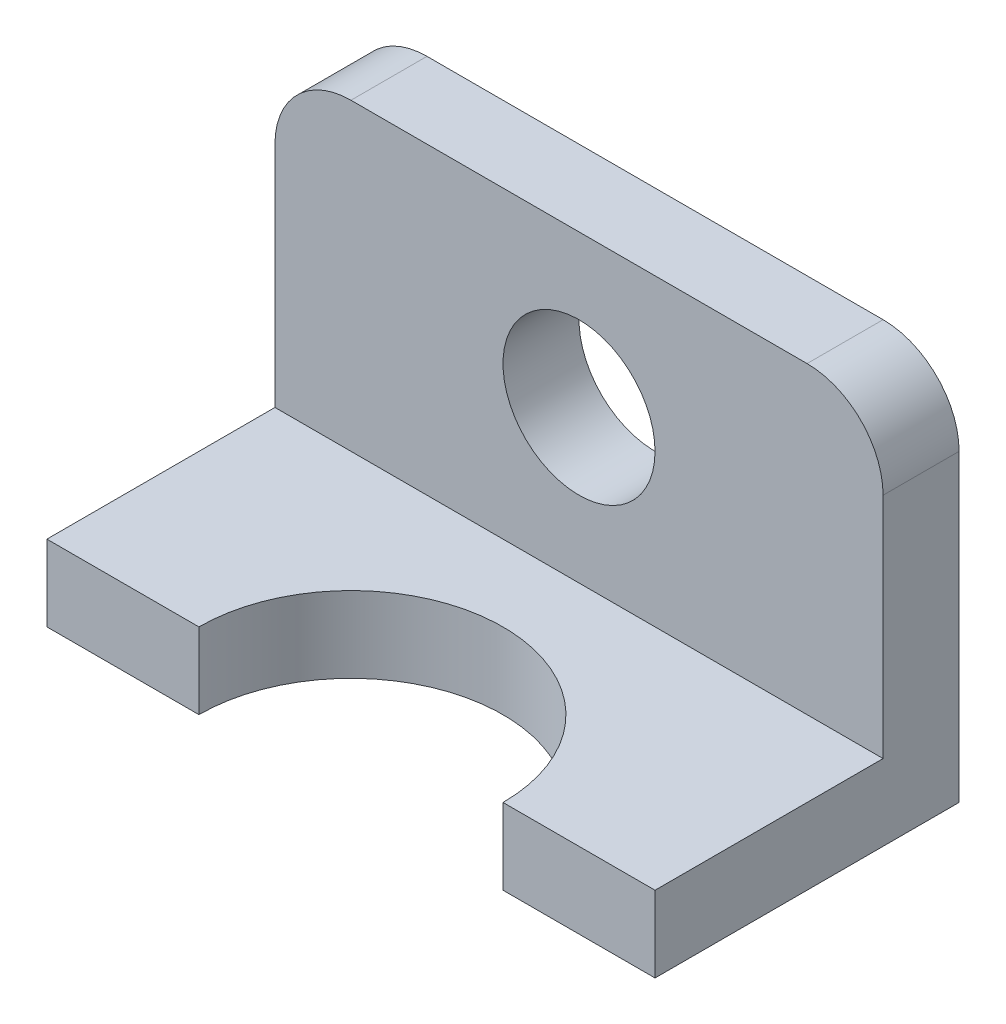
ISO-10303-21;
HEADER;
FILE_DESCRIPTION(('STEP AP214'),'2;1');
FILE_NAME('part.step','',(''),(''),'','','');
FILE_SCHEMA(('AUTOMOTIVE_DESIGN { 1 0 10303 214 1 1 1 1 }'));
ENDSEC;
DATA;
#1=APPLICATION_CONTEXT('core data for automotive mechanical design processes');
#2=APPLICATION_PROTOCOL_DEFINITION('international standard','automotive_design',2000,#1);
#3=PRODUCT_CONTEXT('',#1,'mechanical');
#4=PRODUCT('Part','Part','',(#3));
#5=PRODUCT_RELATED_PRODUCT_CATEGORY('part','',(#4));
#6=PRODUCT_DEFINITION_FORMATION('','',#4);
#7=PRODUCT_DEFINITION_CONTEXT('part definition',#1,'design');
#8=PRODUCT_DEFINITION('design','',#6,#7);
#9=PRODUCT_DEFINITION_SHAPE('','',#8);
#10=(LENGTH_UNIT() NAMED_UNIT(*) SI_UNIT(.MILLI.,.METRE.));
#11=(NAMED_UNIT(*) PLANE_ANGLE_UNIT() SI_UNIT($,.RADIAN.));
#12=(NAMED_UNIT(*) SI_UNIT($,.STERADIAN.) SOLID_ANGLE_UNIT());
#13=UNCERTAINTY_MEASURE_WITH_UNIT(LENGTH_MEASURE(1.E-05),#10,'distance_accuracy_value','');
#14=(GEOMETRIC_REPRESENTATION_CONTEXT(3) GLOBAL_UNCERTAINTY_ASSIGNED_CONTEXT((#13)) GLOBAL_UNIT_ASSIGNED_CONTEXT((#10,
#11,#12)) REPRESENTATION_CONTEXT('',''));
#15=CARTESIAN_POINT('',(0.,0.,0.));
#16=DIRECTION('',(0.,0.,1.));
#17=DIRECTION('',(1.,0.,0.));
#18=AXIS2_PLACEMENT_3D('',#15,#16,#17);
#19=CARTESIAN_POINT('',(0.,12.7,50.8));
#20=DIRECTION('',(0.,-1.,0.));
#21=DIRECTION('',(0.,0.,-1.));
#22=AXIS2_PLACEMENT_3D('',#19,#20,#21);
#23=PLANE('',#22);
#24=DIRECTION('',(1.,0.,0.));
#25=VECTOR('',#24,1.);
#26=CARTESIAN_POINT('',(-50.8,12.7,12.7));
#27=LINE('',#26,#25);
#28=CARTESIAN_POINT('',(-50.8,12.7,12.7));
#29=VERTEX_POINT('',#28);
#30=CARTESIAN_POINT('',(50.8,12.7,12.7));
#31=VERTEX_POINT('',#30);
#32=EDGE_CURVE('E127',#29,#31,#27,.T.);
#33=ORIENTED_EDGE('',*,*,#32,.F.);
#34=DIRECTION('',(0.,0.,1.));
#35=VECTOR('',#34,1.);
#36=CARTESIAN_POINT('',(-50.8,12.7,50.8));
#37=LINE('',#36,#35);
#38=CARTESIAN_POINT('',(-50.8,12.7,50.8));
#39=VERTEX_POINT('',#38);
#40=EDGE_CURVE('E132',#29,#39,#37,.T.);
#41=ORIENTED_EDGE('',*,*,#40,.T.);
#42=DIRECTION('',(1.,0.,0.));
#43=VECTOR('',#42,1.);
#44=CARTESIAN_POINT('',(-50.8,12.7,50.8));
#45=LINE('',#44,#43);
#46=CARTESIAN_POINT('',(-25.4,12.7,50.8));
#47=VERTEX_POINT('',#46);
#48=EDGE_CURVE('E147',#39,#47,#45,.T.);
#49=ORIENTED_EDGE('',*,*,#48,.T.);
#50=CARTESIAN_POINT('',(0.,12.7,50.8));
#51=DIRECTION('',(0.,-1.,0.));
#52=DIRECTION('',(0.,0.,-1.));
#53=AXIS2_PLACEMENT_3D('',#50,#51,#52);
#54=CIRCLE('',#53,25.4);
#55=CARTESIAN_POINT('',(25.4,12.7,50.8));
#56=VERTEX_POINT('',#55);
#57=EDGE_CURVE('E150',#47,#56,#54,.T.);
#58=ORIENTED_EDGE('',*,*,#57,.T.);
#59=DIRECTION('',(1.,0.,0.));
#60=VECTOR('',#59,1.);
#61=CARTESIAN_POINT('',(50.8,12.7,50.8));
#62=LINE('',#61,#60);
#63=CARTESIAN_POINT('',(50.8,12.7,50.8));
#64=VERTEX_POINT('',#63);
#65=EDGE_CURVE('E130',#56,#64,#62,.T.);
#66=ORIENTED_EDGE('',*,*,#65,.T.);
#67=DIRECTION('',(0.,0.,-1.));
#68=VECTOR('',#67,1.);
#69=CARTESIAN_POINT('',(50.8,12.7,0.));
#70=LINE('',#69,#68);
#71=EDGE_CURVE('E119',#64,#31,#70,.T.);
#72=ORIENTED_EDGE('',*,*,#71,.T.);
#73=EDGE_LOOP('',(#33,#41,#49,#58,#66,#72));
#74=FACE_BOUND('',#73,.T.);
#75=ADVANCED_FACE('F40',(#74),#23,.F.);
#76=CARTESIAN_POINT('',(-50.8,12.7,50.8));
#77=DIRECTION('',(0.,0.,-1.));
#78=DIRECTION('',(-1.,0.,0.));
#79=AXIS2_PLACEMENT_3D('',#76,#77,#78);
#80=PLANE('',#79);
#81=DIRECTION('',(1.,0.,0.));
#82=VECTOR('',#81,1.);
#83=CARTESIAN_POINT('',(-50.8,0.,50.8));
#84=LINE('',#83,#82);
#85=CARTESIAN_POINT('',(-50.8,0.,50.8));
#86=VERTEX_POINT('',#85);
#87=CARTESIAN_POINT('',(-25.4,0.,50.8));
#88=VERTEX_POINT('',#87);
#89=EDGE_CURVE('E146',#86,#88,#84,.T.);
#90=ORIENTED_EDGE('',*,*,#89,.T.);
#91=DIRECTION('',(0.,-1.,0.));
#92=VECTOR('',#91,1.);
#93=CARTESIAN_POINT('',(-25.4,12.7,50.8));
#94=LINE('',#93,#92);
#95=EDGE_CURVE('E180',#47,#88,#94,.T.);
#96=ORIENTED_EDGE('',*,*,#95,.F.);
#97=ORIENTED_EDGE('',*,*,#48,.F.);
#98=DIRECTION('',(0.,-1.,0.));
#99=VECTOR('',#98,1.);
#100=CARTESIAN_POINT('',(-50.8,12.7,50.8));
#101=LINE('',#100,#99);
#102=EDGE_CURVE('E155',#39,#86,#101,.T.);
#103=ORIENTED_EDGE('',*,*,#102,.T.);
#104=EDGE_LOOP('',(#90,#96,#97,#103));
#105=FACE_BOUND('',#104,.T.);
#106=ADVANCED_FACE('F222',(#105),#80,.F.);
#107=CARTESIAN_POINT('',(0.,12.7,50.8));
#108=DIRECTION('',(0.,-1.,0.));
#109=DIRECTION('',(0.,0.,-1.));
#110=AXIS2_PLACEMENT_3D('',#107,#108,#109);
#111=CYLINDRICAL_SURFACE('',#110,25.4);
#112=CARTESIAN_POINT('',(0.,0.,50.8));
#113=DIRECTION('',(0.,-1.,0.));
#114=DIRECTION('',(0.,0.,-1.));
#115=AXIS2_PLACEMENT_3D('',#112,#113,#114);
#116=CIRCLE('',#115,25.4);
#117=CARTESIAN_POINT('',(25.4,0.,50.8));
#118=VERTEX_POINT('',#117);
#119=EDGE_CURVE('E158',#88,#118,#116,.T.);
#120=ORIENTED_EDGE('',*,*,#119,.T.);
#121=DIRECTION('',(0.,-1.,0.));
#122=VECTOR('',#121,1.);
#123=CARTESIAN_POINT('',(25.4,12.7,50.8));
#124=LINE('',#123,#122);
#125=EDGE_CURVE('E177',#56,#118,#124,.T.);
#126=ORIENTED_EDGE('',*,*,#125,.F.);
#127=ORIENTED_EDGE('',*,*,#57,.F.);
#128=ORIENTED_EDGE('',*,*,#95,.T.);
#129=EDGE_LOOP('',(#120,#126,#127,#128));
#130=FACE_BOUND('',#129,.T.);
#131=ADVANCED_FACE('F224',(#130),#111,.F.);
#132=CARTESIAN_POINT('',(50.8,12.7,50.8));
#133=DIRECTION('',(0.,0.,-1.));
#134=DIRECTION('',(-1.,0.,0.));
#135=AXIS2_PLACEMENT_3D('',#132,#133,#134);
#136=PLANE('',#135);
#137=DIRECTION('',(1.,0.,0.));
#138=VECTOR('',#137,1.);
#139=CARTESIAN_POINT('',(50.8,0.,50.8));
#140=LINE('',#139,#138);
#141=CARTESIAN_POINT('',(50.8,0.,50.8));
#142=VERTEX_POINT('',#141);
#143=EDGE_CURVE('E160',#118,#142,#140,.T.);
#144=ORIENTED_EDGE('',*,*,#143,.T.);
#145=DIRECTION('',(0.,-1.,0.));
#146=VECTOR('',#145,1.);
#147=CARTESIAN_POINT('',(50.8,12.7,50.8));
#148=LINE('',#147,#146);
#149=EDGE_CURVE('E175',#64,#142,#148,.T.);
#150=ORIENTED_EDGE('',*,*,#149,.F.);
#151=ORIENTED_EDGE('',*,*,#65,.F.);
#152=ORIENTED_EDGE('',*,*,#125,.T.);
#153=EDGE_LOOP('',(#144,#150,#151,#152));
#154=FACE_BOUND('',#153,.T.);
#155=ADVANCED_FACE('F226',(#154),#136,.F.);
#156=CARTESIAN_POINT('',(50.8,12.7,0.));
#157=DIRECTION('',(-1.,0.,0.));
#158=DIRECTION('',(0.,0.,1.));
#159=AXIS2_PLACEMENT_3D('',#156,#157,#158);
#160=PLANE('',#159);
#161=DIRECTION('',(0.,-1.,0.));
#162=VECTOR('',#161,1.);
#163=CARTESIAN_POINT('',(50.8,12.7,0.));
#164=LINE('',#163,#162);
#165=CARTESIAN_POINT('',(50.8,50.8,0.));
#166=VERTEX_POINT('',#165);
#167=CARTESIAN_POINT('',(50.8,0.,0.));
#168=VERTEX_POINT('',#167);
#169=EDGE_CURVE('E173',#166,#168,#164,.T.);
#170=ORIENTED_EDGE('',*,*,#169,.F.);
#171=DIRECTION('',(0.,0.,-1.));
#172=VECTOR('',#171,1.);
#173=CARTESIAN_POINT('',(50.8,50.8,12.7));
#174=LINE('',#173,#172);
#175=CARTESIAN_POINT('',(50.8,50.8,12.7));
#176=VERTEX_POINT('',#175);
#177=EDGE_CURVE('E63',#166,#176,#174,.F.);
#178=ORIENTED_EDGE('',*,*,#177,.T.);
#179=DIRECTION('',(0.,-1.,0.));
#180=VECTOR('',#179,1.);
#181=CARTESIAN_POINT('',(50.8,63.5,12.7));
#182=LINE('',#181,#180);
#183=EDGE_CURVE('E115',#176,#31,#182,.T.);
#184=ORIENTED_EDGE('',*,*,#183,.T.);
#185=ORIENTED_EDGE('',*,*,#71,.F.);
#186=ORIENTED_EDGE('',*,*,#149,.T.);
#187=DIRECTION('',(0.,0.,-1.));
#188=VECTOR('',#187,1.);
#189=CARTESIAN_POINT('',(50.8,0.,0.));
#190=LINE('',#189,#188);
#191=EDGE_CURVE('E162',#142,#168,#190,.T.);
#192=ORIENTED_EDGE('',*,*,#191,.T.);
#193=EDGE_LOOP('',(#170,#178,#184,#185,#186,#192));
#194=FACE_BOUND('',#193,.T.);
#195=ADVANCED_FACE('F117',(#194),#160,.F.);
#196=CARTESIAN_POINT('',(-50.8,12.7,0.));
#197=DIRECTION('',(0.,0.,1.));
#198=DIRECTION('',(1.,0.,0.));
#199=AXIS2_PLACEMENT_3D('',#196,#197,#198);
#200=PLANE('',#199);
#201=CARTESIAN_POINT('',(0.,38.1,0.));
#202=DIRECTION('',(0.,0.,1.));
#203=DIRECTION('',(1.,0.,0.));
#204=AXIS2_PLACEMENT_3D('',#201,#202,#203);
#205=CIRCLE('',#204,12.7);
#206=CARTESIAN_POINT('',(12.7,38.1,0.));
#207=VERTEX_POINT('',#206);
#208=EDGE_CURVE('E136',#207,#207,#205,.T.);
#209=ORIENTED_EDGE('',*,*,#208,.T.);
#210=EDGE_LOOP('',(#209));
#211=FACE_BOUND('',#210,.T.);
#212=DIRECTION('',(-1.,0.,0.));
#213=VECTOR('',#212,1.);
#214=CARTESIAN_POINT('',(-50.8,63.5,0.));
#215=LINE('',#214,#213);
#216=CARTESIAN_POINT('',(38.1,63.5,0.));
#217=VERTEX_POINT('',#216);
#218=CARTESIAN_POINT('',(-38.1,63.5,0.));
#219=VERTEX_POINT('',#218);
#220=EDGE_CURVE('E123',#217,#219,#215,.T.);
#221=ORIENTED_EDGE('',*,*,#220,.F.);
#222=CARTESIAN_POINT('',(38.1,50.8,0.));
#223=DIRECTION('',(0.,0.,1.));
#224=DIRECTION('',(1.,0.,0.));
#225=AXIS2_PLACEMENT_3D('',#222,#223,#224);
#226=CIRCLE('',#225,12.7);
#227=EDGE_CURVE('E191',#217,#166,#226,.F.);
#228=ORIENTED_EDGE('',*,*,#227,.T.);
#229=ORIENTED_EDGE('',*,*,#169,.T.);
#230=DIRECTION('',(-1.,0.,0.));
#231=VECTOR('',#230,1.);
#232=CARTESIAN_POINT('',(-50.8,0.,0.));
#233=LINE('',#232,#231);
#234=CARTESIAN_POINT('',(-50.8,0.,0.));
#235=VERTEX_POINT('',#234);
#236=EDGE_CURVE('E165',#168,#235,#233,.T.);
#237=ORIENTED_EDGE('',*,*,#236,.T.);
#238=DIRECTION('',(0.,-1.,0.));
#239=VECTOR('',#238,1.);
#240=CARTESIAN_POINT('',(-50.8,12.7,0.));
#241=LINE('',#240,#239);
#242=CARTESIAN_POINT('',(-50.8,50.8,0.));
#243=VERTEX_POINT('',#242);
#244=EDGE_CURVE('E171',#243,#235,#241,.T.);
#245=ORIENTED_EDGE('',*,*,#244,.F.);
#246=CARTESIAN_POINT('',(-38.1,50.8,0.));
#247=DIRECTION('',(0.,0.,1.));
#248=DIRECTION('',(1.,0.,0.));
#249=AXIS2_PLACEMENT_3D('',#246,#247,#248);
#250=CIRCLE('',#249,12.7);
#251=EDGE_CURVE('E189',#243,#219,#250,.F.);
#252=ORIENTED_EDGE('',*,*,#251,.T.);
#253=EDGE_LOOP('',(#221,#228,#229,#237,#245,#252));
#254=FACE_BOUND('',#253,.T.);
#255=ADVANCED_FACE('F203',(#211,#254),#200,.F.);
#256=CARTESIAN_POINT('',(-50.8,12.7,50.8));
#257=DIRECTION('',(1.,0.,0.));
#258=DIRECTION('',(0.,0.,-1.));
#259=AXIS2_PLACEMENT_3D('',#256,#257,#258);
#260=PLANE('',#259);
#261=DIRECTION('',(0.,-1.,0.));
#262=VECTOR('',#261,1.);
#263=CARTESIAN_POINT('',(-50.8,63.5,12.7));
#264=LINE('',#263,#262);
#265=CARTESIAN_POINT('',(-50.8,50.8,12.7));
#266=VERTEX_POINT('',#265);
#267=EDGE_CURVE('E122',#266,#29,#264,.T.);
#268=ORIENTED_EDGE('',*,*,#267,.F.);
#269=DIRECTION('',(0.,0.,1.));
#270=VECTOR('',#269,1.);
#271=CARTESIAN_POINT('',(-50.8,50.8,0.));
#272=LINE('',#271,#270);
#273=EDGE_CURVE('E11',#266,#243,#272,.F.);
#274=ORIENTED_EDGE('',*,*,#273,.T.);
#275=ORIENTED_EDGE('',*,*,#244,.T.);
#276=DIRECTION('',(0.,0.,1.));
#277=VECTOR('',#276,1.);
#278=CARTESIAN_POINT('',(-50.8,0.,50.8));
#279=LINE('',#278,#277);
#280=EDGE_CURVE('E151',#235,#86,#279,.T.);
#281=ORIENTED_EDGE('',*,*,#280,.T.);
#282=ORIENTED_EDGE('',*,*,#102,.F.);
#283=ORIENTED_EDGE('',*,*,#40,.F.);
#284=EDGE_LOOP('',(#268,#274,#275,#281,#282,#283));
#285=FACE_BOUND('',#284,.T.);
#286=ADVANCED_FACE('F216',(#285),#260,.F.);
#287=CARTESIAN_POINT('',(0.,0.,50.8));
#288=DIRECTION('',(0.,-1.,0.));
#289=DIRECTION('',(0.,0.,-1.));
#290=AXIS2_PLACEMENT_3D('',#287,#288,#289);
#291=PLANE('',#290);
#292=ORIENTED_EDGE('',*,*,#89,.F.);
#293=ORIENTED_EDGE('',*,*,#280,.F.);
#294=ORIENTED_EDGE('',*,*,#236,.F.);
#295=ORIENTED_EDGE('',*,*,#191,.F.);
#296=ORIENTED_EDGE('',*,*,#143,.F.);
#297=ORIENTED_EDGE('',*,*,#119,.F.);
#298=EDGE_LOOP('',(#292,#293,#294,#295,#296,#297));
#299=FACE_BOUND('',#298,.T.);
#300=ADVANCED_FACE('F210',(#299),#291,.T.);
#301=CARTESIAN_POINT('',(-50.8,63.5,12.7));
#302=DIRECTION('',(0.,0.,-1.));
#303=DIRECTION('',(-1.,0.,0.));
#304=AXIS2_PLACEMENT_3D('',#301,#302,#303);
#305=PLANE('',#304);
#306=CARTESIAN_POINT('',(0.,38.1,12.7));
#307=DIRECTION('',(0.,0.,1.));
#308=DIRECTION('',(1.,0.,0.));
#309=AXIS2_PLACEMENT_3D('',#306,#307,#308);
#310=CIRCLE('',#309,12.7);
#311=CARTESIAN_POINT('',(12.7,38.1,12.7));
#312=VERTEX_POINT('',#311);
#313=EDGE_CURVE('E141',#312,#312,#310,.T.);
#314=ORIENTED_EDGE('',*,*,#313,.F.);
#315=EDGE_LOOP('',(#314));
#316=FACE_BOUND('',#315,.T.);
#317=ORIENTED_EDGE('',*,*,#183,.F.);
#318=CARTESIAN_POINT('',(38.1,50.8,12.7));
#319=DIRECTION('',(0.,0.,-1.));
#320=DIRECTION('',(-1.,0.,0.));
#321=AXIS2_PLACEMENT_3D('',#318,#319,#320);
#322=CIRCLE('',#321,12.7);
#323=CARTESIAN_POINT('',(38.1,63.5,12.7));
#324=VERTEX_POINT('',#323);
#325=EDGE_CURVE('E48',#176,#324,#322,.F.);
#326=ORIENTED_EDGE('',*,*,#325,.T.);
#327=DIRECTION('',(1.,0.,0.));
#328=VECTOR('',#327,1.);
#329=CARTESIAN_POINT('',(-50.8,63.5,12.7));
#330=LINE('',#329,#328);
#331=CARTESIAN_POINT('',(-38.1,63.5,12.7));
#332=VERTEX_POINT('',#331);
#333=EDGE_CURVE('E135',#332,#324,#330,.T.);
#334=ORIENTED_EDGE('',*,*,#333,.F.);
#335=CARTESIAN_POINT('',(-38.1,50.8,12.7));
#336=DIRECTION('',(0.,0.,-1.));
#337=DIRECTION('',(-1.,0.,0.));
#338=AXIS2_PLACEMENT_3D('',#335,#336,#337);
#339=CIRCLE('',#338,12.7);
#340=EDGE_CURVE('E55',#332,#266,#339,.F.);
#341=ORIENTED_EDGE('',*,*,#340,.T.);
#342=ORIENTED_EDGE('',*,*,#267,.T.);
#343=ORIENTED_EDGE('',*,*,#32,.T.);
#344=EDGE_LOOP('',(#317,#326,#334,#341,#342,#343));
#345=FACE_BOUND('',#344,.T.);
#346=ADVANCED_FACE('F134',(#316,#345),#305,.F.);
#347=CARTESIAN_POINT('',(0.,63.5,0.));
#348=DIRECTION('',(0.,1.,0.));
#349=DIRECTION('',(0.,0.,1.));
#350=AXIS2_PLACEMENT_3D('',#347,#348,#349);
#351=PLANE('',#350);
#352=ORIENTED_EDGE('',*,*,#333,.T.);
#353=DIRECTION('',(0.,0.,-1.));
#354=VECTOR('',#353,1.);
#355=CARTESIAN_POINT('',(38.1,63.5,0.));
#356=LINE('',#355,#354);
#357=EDGE_CURVE('E186',#324,#217,#356,.T.);
#358=ORIENTED_EDGE('',*,*,#357,.T.);
#359=ORIENTED_EDGE('',*,*,#220,.T.);
#360=DIRECTION('',(0.,0.,1.));
#361=VECTOR('',#360,1.);
#362=CARTESIAN_POINT('',(-38.1,63.5,12.7));
#363=LINE('',#362,#361);
#364=EDGE_CURVE('E183',#219,#332,#363,.T.);
#365=ORIENTED_EDGE('',*,*,#364,.T.);
#366=EDGE_LOOP('',(#352,#358,#359,#365));
#367=FACE_BOUND('',#366,.T.);
#368=ADVANCED_FACE('F197',(#367),#351,.T.);
#369=CARTESIAN_POINT('',(0.,38.1,0.));
#370=DIRECTION('',(0.,0.,1.));
#371=DIRECTION('',(1.,0.,0.));
#372=AXIS2_PLACEMENT_3D('',#369,#370,#371);
#373=CYLINDRICAL_SURFACE('',#372,12.7);
#374=ORIENTED_EDGE('',*,*,#208,.F.);
#375=EDGE_LOOP('',(#374));
#376=FACE_BOUND('',#375,.T.);
#377=ORIENTED_EDGE('',*,*,#313,.T.);
#378=EDGE_LOOP('',(#377));
#379=FACE_BOUND('',#378,.T.);
#380=ADVANCED_FACE('F254',(#376,#379),#373,.F.);
#381=CARTESIAN_POINT('',(38.1,50.8,0.));
#382=DIRECTION('',(0.,0.,1.));
#383=DIRECTION('',(1.,0.,0.));
#384=AXIS2_PLACEMENT_3D('',#381,#382,#383);
#385=CYLINDRICAL_SURFACE('',#384,12.7);
#386=ORIENTED_EDGE('',*,*,#325,.F.);
#387=ORIENTED_EDGE('',*,*,#177,.F.);
#388=ORIENTED_EDGE('',*,*,#227,.F.);
#389=ORIENTED_EDGE('',*,*,#357,.F.);
#390=EDGE_LOOP('',(#386,#387,#388,#389));
#391=FACE_BOUND('',#390,.T.);
#392=ADVANCED_FACE('F201',(#391),#385,.T.);
#393=CARTESIAN_POINT('',(-38.1,50.8,0.));
#394=DIRECTION('',(0.,0.,-1.));
#395=DIRECTION('',(-1.,0.,0.));
#396=AXIS2_PLACEMENT_3D('',#393,#394,#395);
#397=CYLINDRICAL_SURFACE('',#396,12.7);
#398=ORIENTED_EDGE('',*,*,#251,.F.);
#399=ORIENTED_EDGE('',*,*,#273,.F.);
#400=ORIENTED_EDGE('',*,*,#340,.F.);
#401=ORIENTED_EDGE('',*,*,#364,.F.);
#402=EDGE_LOOP('',(#398,#399,#400,#401));
#403=FACE_BOUND('',#402,.T.);
#404=ADVANCED_FACE('F42',(#403),#397,.T.);
#405=CLOSED_SHELL('',(#75,#106,#131,#155,#195,#255,#286,#300,#346,#368,#380,#392,#404));
#406=MANIFOLD_SOLID_BREP('B2',#405);
#407=ADVANCED_BREP_SHAPE_REPRESENTATION('',(#18,#406),#14);
#408=SHAPE_DEFINITION_REPRESENTATION(#9,#407);
ENDSEC;
END-ISO-10303-21;
